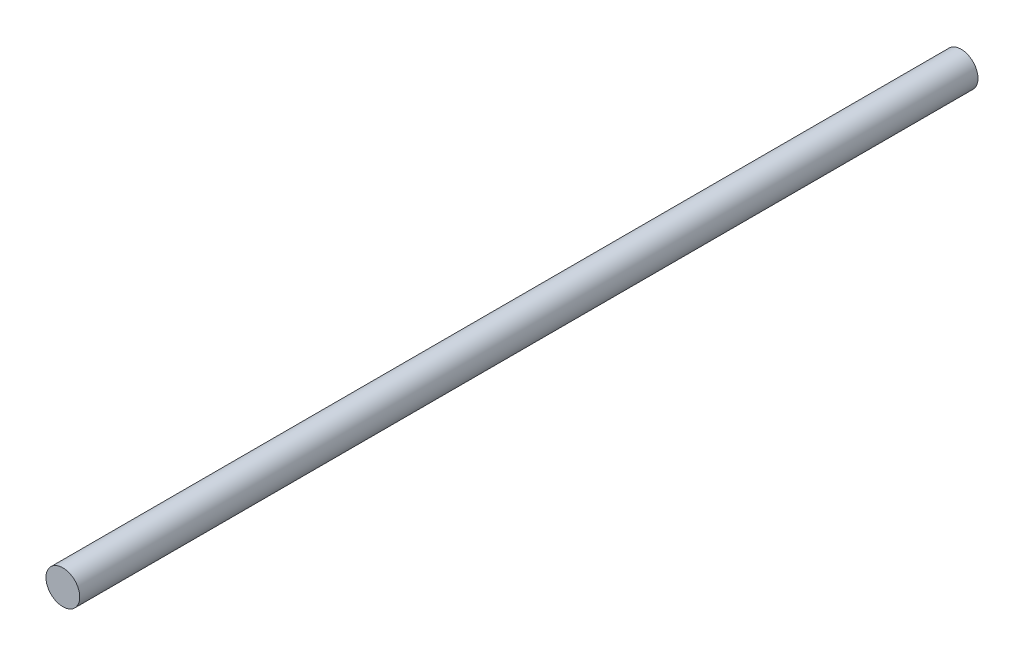
ISO-10303-21;
HEADER;
FILE_DESCRIPTION(('STEP AP214'),'2;1');
FILE_NAME('part.step','',(''),(''),'','','');
FILE_SCHEMA(('AUTOMOTIVE_DESIGN { 1 0 10303 214 1 1 1 1 }'));
ENDSEC;
DATA;
#1=APPLICATION_CONTEXT('core data for automotive mechanical design processes');
#2=APPLICATION_PROTOCOL_DEFINITION('international standard','automotive_design',2000,#1);
#3=PRODUCT_CONTEXT('',#1,'mechanical');
#4=PRODUCT('Part','Part','',(#3));
#5=PRODUCT_RELATED_PRODUCT_CATEGORY('part','',(#4));
#6=PRODUCT_DEFINITION_FORMATION('','',#4);
#7=PRODUCT_DEFINITION_CONTEXT('part definition',#1,'design');
#8=PRODUCT_DEFINITION('design','',#6,#7);
#9=PRODUCT_DEFINITION_SHAPE('','',#8);
#10=(LENGTH_UNIT() NAMED_UNIT(*) SI_UNIT(.MILLI.,.METRE.));
#11=(NAMED_UNIT(*) PLANE_ANGLE_UNIT() SI_UNIT($,.RADIAN.));
#12=(NAMED_UNIT(*) SI_UNIT($,.STERADIAN.) SOLID_ANGLE_UNIT());
#13=UNCERTAINTY_MEASURE_WITH_UNIT(LENGTH_MEASURE(1.E-05),#10,'distance_accuracy_value','');
#14=(GEOMETRIC_REPRESENTATION_CONTEXT(3) GLOBAL_UNCERTAINTY_ASSIGNED_CONTEXT((#13)) GLOBAL_UNIT_ASSIGNED_CONTEXT((#10,
#11,#12)) REPRESENTATION_CONTEXT('',''));
#15=CARTESIAN_POINT('',(0.,0.,0.));
#16=DIRECTION('',(0.,0.,1.));
#17=DIRECTION('',(1.,0.,0.));
#18=AXIS2_PLACEMENT_3D('',#15,#16,#17);
#19=CARTESIAN_POINT('',(-8.76111799363543,6.92410938206671,266.));
#20=DIRECTION('',(0.,0.,-1.));
#21=DIRECTION('',(-1.,0.,0.));
#22=AXIS2_PLACEMENT_3D('',#19,#20,#21);
#23=CYLINDRICAL_SURFACE('',#22,5.);
#24=CARTESIAN_POINT('',(-8.76111799363543,6.92410938206671,266.));
#25=DIRECTION('',(0.,0.,1.));
#26=DIRECTION('',(1.,0.,0.));
#27=AXIS2_PLACEMENT_3D('',#24,#25,#26);
#28=CIRCLE('',#27,5.);
#29=CARTESIAN_POINT('',(-3.76111799363543,6.92410938206671,266.));
#30=VERTEX_POINT('',#29);
#31=EDGE_CURVE('E10',#30,#30,#28,.T.);
#32=ORIENTED_EDGE('',*,*,#31,.F.);
#33=EDGE_LOOP('',(#32));
#34=FACE_BOUND('',#33,.T.);
#35=CARTESIAN_POINT('',(-8.76111799363543,6.92410938206671,0.));
#36=DIRECTION('',(0.,0.,1.));
#37=DIRECTION('',(1.,0.,0.));
#38=AXIS2_PLACEMENT_3D('',#35,#36,#37);
#39=CIRCLE('',#38,5.);
#40=CARTESIAN_POINT('',(-3.76111799363543,6.92410938206671,0.));
#41=VERTEX_POINT('',#40);
#42=EDGE_CURVE('E34',#41,#41,#39,.T.);
#43=ORIENTED_EDGE('',*,*,#42,.T.);
#44=EDGE_LOOP('',(#43));
#45=FACE_BOUND('',#44,.T.);
#46=ADVANCED_FACE('F31',(#34,#45),#23,.T.);
#47=CARTESIAN_POINT('',(-8.76111799363543,6.92410938206671,266.));
#48=DIRECTION('',(0.,0.,1.));
#49=DIRECTION('',(1.,0.,0.));
#50=AXIS2_PLACEMENT_3D('',#47,#48,#49);
#51=PLANE('',#50);
#52=ORIENTED_EDGE('',*,*,#31,.T.);
#53=EDGE_LOOP('',(#52));
#54=FACE_BOUND('',#53,.T.);
#55=ADVANCED_FACE('F46',(#54),#51,.T.);
#56=CARTESIAN_POINT('',(-8.76111799363543,6.92410938206671,0.));
#57=DIRECTION('',(0.,0.,1.));
#58=DIRECTION('',(1.,0.,0.));
#59=AXIS2_PLACEMENT_3D('',#56,#57,#58);
#60=PLANE('',#59);
#61=ORIENTED_EDGE('',*,*,#42,.F.);
#62=EDGE_LOOP('',(#61));
#63=FACE_BOUND('',#62,.T.);
#64=ADVANCED_FACE('F44',(#63),#60,.F.);
#65=CLOSED_SHELL('',(#46,#55,#64));
#66=MANIFOLD_SOLID_BREP('B2',#65);
#67=ADVANCED_BREP_SHAPE_REPRESENTATION('',(#18,#66),#14);
#68=SHAPE_DEFINITION_REPRESENTATION(#9,#67);
ENDSEC;
END-ISO-10303-21;
